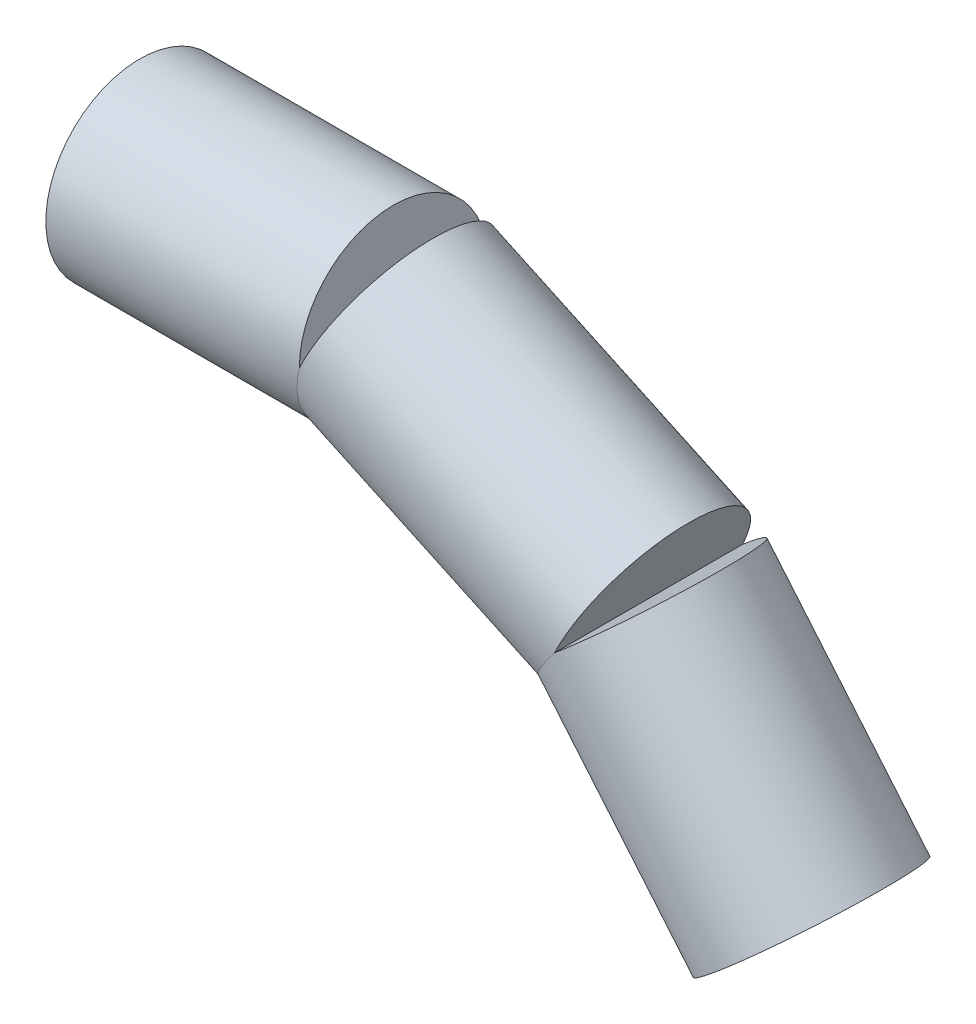
ISO-10303-21;
HEADER;
FILE_DESCRIPTION(('STEP AP214'),'2;1');
FILE_NAME('part.step','',(''),(''),'','','');
FILE_SCHEMA(('AUTOMOTIVE_DESIGN { 1 0 10303 214 1 1 1 1 }'));
ENDSEC;
DATA;
#1=APPLICATION_CONTEXT('core data for automotive mechanical design processes');
#2=APPLICATION_PROTOCOL_DEFINITION('international standard','automotive_design',2000,#1);
#3=PRODUCT_CONTEXT('',#1,'mechanical');
#4=PRODUCT('Part','Part','',(#3));
#5=PRODUCT_RELATED_PRODUCT_CATEGORY('part','',(#4));
#6=PRODUCT_DEFINITION_FORMATION('','',#4);
#7=PRODUCT_DEFINITION_CONTEXT('part definition',#1,'design');
#8=PRODUCT_DEFINITION('design','',#6,#7);
#9=PRODUCT_DEFINITION_SHAPE('','',#8);
#10=(LENGTH_UNIT() NAMED_UNIT(*) SI_UNIT(.MILLI.,.METRE.));
#11=(NAMED_UNIT(*) PLANE_ANGLE_UNIT() SI_UNIT($,.RADIAN.));
#12=(NAMED_UNIT(*) SI_UNIT($,.STERADIAN.) SOLID_ANGLE_UNIT());
#13=UNCERTAINTY_MEASURE_WITH_UNIT(LENGTH_MEASURE(1.E-05),#10,'distance_accuracy_value','');
#14=(GEOMETRIC_REPRESENTATION_CONTEXT(3) GLOBAL_UNCERTAINTY_ASSIGNED_CONTEXT((#13)) GLOBAL_UNIT_ASSIGNED_CONTEXT((#10,
#11,#12)) REPRESENTATION_CONTEXT('',''));
#15=CARTESIAN_POINT('',(0.,0.,0.));
#16=DIRECTION('',(0.,0.,1.));
#17=DIRECTION('',(1.,0.,0.));
#18=AXIS2_PLACEMENT_3D('',#15,#16,#17);
#19=CARTESIAN_POINT('',(45.72,0.,0.));
#20=DIRECTION('',(-1.,0.,0.));
#21=DIRECTION('',(0.,0.,1.));
#22=AXIS2_PLACEMENT_3D('',#19,#20,#21);
#23=CYLINDRICAL_SURFACE('',#22,16.9545);
#24=CARTESIAN_POINT('',(0.,0.,0.));
#25=DIRECTION('',(1.,0.,0.));
#26=DIRECTION('',(0.,0.,-1.));
#27=AXIS2_PLACEMENT_3D('',#24,#25,#26);
#28=CIRCLE('',#27,16.9545);
#29=CARTESIAN_POINT('',(0.,0.,-16.9545));
#30=VERTEX_POINT('',#29);
#31=EDGE_CURVE('E88',#30,#30,#28,.T.);
#32=ORIENTED_EDGE('',*,*,#31,.T.);
#33=EDGE_LOOP('',(#32));
#34=FACE_BOUND('',#33,.T.);
#35=CARTESIAN_POINT('',(45.72,0.,0.));
#36=DIRECTION('',(-0.976296007119933,0.216439613938103,0.));
#37=DIRECTION('',(-0.216439613938103,-0.976296007119933,0.));
#38=AXIS2_PLACEMENT_3D('',#35,#36,#37);
#39=ELLIPSE('',#38,17.3661470254453,16.9545);
#40=CARTESIAN_POINT('',(45.72,0.,16.9545));
#41=VERTEX_POINT('',#40);
#42=CARTESIAN_POINT('',(45.72,0.,-16.9545));
#43=VERTEX_POINT('',#42);
#44=EDGE_CURVE('E63',#41,#43,#39,.F.);
#45=ORIENTED_EDGE('',*,*,#44,.F.);
#46=CARTESIAN_POINT('',(45.72,0.,0.));
#47=DIRECTION('',(1.,0.,0.));
#48=DIRECTION('',(0.,0.,-1.));
#49=AXIS2_PLACEMENT_3D('',#46,#47,#48);
#50=CIRCLE('',#49,16.9545);
#51=EDGE_CURVE('E89',#43,#41,#50,.T.);
#52=ORIENTED_EDGE('',*,*,#51,.F.);
#53=EDGE_LOOP('',(#45,#52));
#54=FACE_BOUND('',#53,.T.);
#55=ADVANCED_FACE('F35',(#34,#54),#23,.T.);
#56=CARTESIAN_POINT('',(45.72,0.,0.));
#57=DIRECTION('',(1.,0.,0.));
#58=DIRECTION('',(0.,0.,-1.));
#59=AXIS2_PLACEMENT_3D('',#56,#57,#58);
#60=PLANE('',#59);
#61=ORIENTED_EDGE('',*,*,#51,.T.);
#62=DIRECTION('',(0.,0.,-1.));
#63=VECTOR('',#62,1.);
#64=CARTESIAN_POINT('',(45.72,0.,0.));
#65=LINE('',#64,#63);
#66=EDGE_CURVE('E42',#41,#43,#65,.T.);
#67=ORIENTED_EDGE('',*,*,#66,.T.);
#68=EDGE_LOOP('',(#61,#67));
#69=FACE_BOUND('',#68,.T.);
#70=ADVANCED_FACE('F96',(#69),#60,.T.);
#71=CARTESIAN_POINT('',(0.,0.,0.));
#72=DIRECTION('',(1.,0.,0.));
#73=DIRECTION('',(0.,0.,-1.));
#74=AXIS2_PLACEMENT_3D('',#71,#72,#73);
#75=PLANE('',#74);
#76=CARTESIAN_POINT('',(0.,0.,0.));
#77=DIRECTION('',(-1.,0.,0.));
#78=DIRECTION('',(0.,0.,1.));
#79=AXIS2_PLACEMENT_3D('',#76,#77,#78);
#80=CIRCLE('',#79,9.525);
#81=CARTESIAN_POINT('',(0.,0.,9.525));
#82=VERTEX_POINT('',#81);
#83=EDGE_CURVE('E225',#82,#82,#80,.T.);
#84=ORIENTED_EDGE('',*,*,#83,.F.);
#85=EDGE_LOOP('',(#84));
#86=FACE_BOUND('',#85,.T.);
#87=ORIENTED_EDGE('',*,*,#31,.F.);
#88=EDGE_LOOP('',(#87));
#89=FACE_BOUND('',#88,.T.);
#90=ADVANCED_FACE('F100',(#86,#89),#75,.F.);
#91=CARTESIAN_POINT('',(91.7604355814618,-21.4690076964276,0.));
#92=DIRECTION('',(-0.90630778703665,0.4226182617407,0.));
#93=DIRECTION('',(-0.4226182617407,-0.90630778703665,0.));
#94=AXIS2_PLACEMENT_3D('',#91,#92,#93);
#95=CYLINDRICAL_SURFACE('',#94,16.9545);
#96=CARTESIAN_POINT('',(91.7604355814618,-21.4690076964276,0.));
#97=DIRECTION('',(0.90630778703665,-0.4226182617407,0.));
#98=DIRECTION('',(0.4226182617407,0.90630778703665,0.));
#99=AXIS2_PLACEMENT_3D('',#96,#97,#98);
#100=CIRCLE('',#99,16.9545);
#101=CARTESIAN_POINT('',(91.7604355814618,-21.4690076964275,-16.9545));
#102=VERTEX_POINT('',#101);
#103=CARTESIAN_POINT('',(91.7604355814618,-21.4690076964275,16.9545));
#104=VERTEX_POINT('',#103);
#105=EDGE_CURVE('E58',#102,#104,#100,.T.);
#106=ORIENTED_EDGE('',*,*,#105,.F.);
#107=CARTESIAN_POINT('',(91.7604355814619,-21.4690076964277,0.));
#108=DIRECTION('',(-0.793353340291234,0.608761429008722,0.));
#109=DIRECTION('',(-0.608761429008722,-0.793353340291234,0.));
#110=AXIS2_PLACEMENT_3D('',#107,#108,#109);
#111=ELLIPSE('',#110,17.3661470254453,16.9545);
#112=EDGE_CURVE('E65',#102,#104,#111,.T.);
#113=ORIENTED_EDGE('',*,*,#112,.T.);
#114=EDGE_LOOP('',(#106,#113));
#115=FACE_BOUND('',#114,.T.);
#116=CARTESIAN_POINT('',(45.72,0.,0.));
#117=DIRECTION('',(0.90630778703665,-0.4226182617407,0.));
#118=DIRECTION('',(0.4226182617407,0.90630778703665,0.));
#119=AXIS2_PLACEMENT_3D('',#116,#117,#118);
#120=CIRCLE('',#119,16.9545);
#121=EDGE_CURVE('E53',#43,#41,#120,.T.);
#122=ORIENTED_EDGE('',*,*,#121,.T.);
#123=ORIENTED_EDGE('',*,*,#44,.T.);
#124=EDGE_LOOP('',(#122,#123));
#125=FACE_BOUND('',#124,.T.);
#126=ADVANCED_FACE('F66',(#115,#125),#95,.T.);
#127=CARTESIAN_POINT('',(91.7604355814618,-21.4690076964276,0.));
#128=DIRECTION('',(0.90630778703665,-0.4226182617407,0.));
#129=DIRECTION('',(0.4226182617407,0.90630778703665,0.));
#130=AXIS2_PLACEMENT_3D('',#127,#128,#129);
#131=PLANE('',#130);
#132=DIRECTION('',(0.,0.,1.));
#133=VECTOR('',#132,1.);
#134=CARTESIAN_POINT('',(91.7604355814618,-21.4690076964275,0.));
#135=LINE('',#134,#133);
#136=EDGE_CURVE('E11',#102,#104,#135,.T.);
#137=ORIENTED_EDGE('',*,*,#136,.F.);
#138=ORIENTED_EDGE('',*,*,#105,.T.);
#139=EDGE_LOOP('',(#137,#138));
#140=FACE_BOUND('',#139,.T.);
#141=ADVANCED_FACE('F60',(#140),#131,.T.);
#142=CARTESIAN_POINT('',(45.72,0.,0.));
#143=DIRECTION('',(0.90630778703665,-0.4226182617407,0.));
#144=DIRECTION('',(0.4226182617407,0.90630778703665,0.));
#145=AXIS2_PLACEMENT_3D('',#142,#143,#144);
#146=PLANE('',#145);
#147=ORIENTED_EDGE('',*,*,#66,.F.);
#148=ORIENTED_EDGE('',*,*,#121,.F.);
#149=EDGE_LOOP('',(#147,#148));
#150=FACE_BOUND('',#149,.T.);
#151=ADVANCED_FACE('F106',(#150),#146,.F.);
#152=CARTESIAN_POINT('',(121.14868509633,-56.4925596358273,0.));
#153=DIRECTION('',(-0.642787609686538,0.766044443118979,0.));
#154=DIRECTION('',(-0.766044443118979,-0.642787609686538,0.));
#155=AXIS2_PLACEMENT_3D('',#152,#153,#154);
#156=CYLINDRICAL_SURFACE('',#155,16.9545);
#157=CARTESIAN_POINT('',(121.14868509633,-56.4925596358273,0.));
#158=DIRECTION('',(-0.642787609686538,0.766044443118979,0.));
#159=DIRECTION('',(-0.766044443118979,-0.642787609686538,0.));
#160=AXIS2_PLACEMENT_3D('',#157,#158,#159);
#161=CIRCLE('',#160,16.9545);
#162=CARTESIAN_POINT('',(108.16078458547,-67.3907021642577,0.));
#163=VERTEX_POINT('',#162);
#164=EDGE_CURVE('E71',#163,#163,#161,.T.);
#165=ORIENTED_EDGE('',*,*,#164,.T.);
#166=EDGE_LOOP('',(#165));
#167=FACE_BOUND('',#166,.T.);
#168=ORIENTED_EDGE('',*,*,#112,.F.);
#169=CARTESIAN_POINT('',(91.7604355814618,-21.4690076964276,0.));
#170=DIRECTION('',(-0.642787609686538,0.766044443118979,0.));
#171=DIRECTION('',(-0.766044443118979,-0.642787609686538,0.));
#172=AXIS2_PLACEMENT_3D('',#169,#170,#171);
#173=CIRCLE('',#172,16.9545);
#174=EDGE_CURVE('E75',#104,#102,#173,.T.);
#175=ORIENTED_EDGE('',*,*,#174,.F.);
#176=EDGE_LOOP('',(#168,#175));
#177=FACE_BOUND('',#176,.T.);
#178=ADVANCED_FACE('F76',(#167,#177),#156,.T.);
#179=CARTESIAN_POINT('',(121.14868509633,-56.4925596358273,0.));
#180=DIRECTION('',(-0.642787609686538,0.766044443118979,0.));
#181=DIRECTION('',(-0.766044443118979,-0.642787609686538,0.));
#182=AXIS2_PLACEMENT_3D('',#179,#180,#181);
#183=PLANE('',#182);
#184=CARTESIAN_POINT('',(121.14868509633,-56.4925596358273,0.));
#185=DIRECTION('',(0.642787609686538,-0.766044443118979,0.));
#186=DIRECTION('',(0.766044443118979,0.642787609686538,0.));
#187=AXIS2_PLACEMENT_3D('',#184,#185,#186);
#188=CIRCLE('',#187,9.52500000000004);
#189=CARTESIAN_POINT('',(128.445258417039,-50.370007653563,0.));
#190=VERTEX_POINT('',#189);
#191=EDGE_CURVE('E82',#190,#190,#188,.T.);
#192=ORIENTED_EDGE('',*,*,#191,.F.);
#193=EDGE_LOOP('',(#192));
#194=FACE_BOUND('',#193,.T.);
#195=ORIENTED_EDGE('',*,*,#164,.F.);
#196=EDGE_LOOP('',(#195));
#197=FACE_BOUND('',#196,.T.);
#198=ADVANCED_FACE('F163',(#194,#197),#183,.F.);
#199=CARTESIAN_POINT('',(91.7604355814618,-21.4690076964276,0.));
#200=DIRECTION('',(-0.642787609686538,0.766044443118979,0.));
#201=DIRECTION('',(-0.766044443118979,-0.642787609686538,0.));
#202=AXIS2_PLACEMENT_3D('',#199,#200,#201);
#203=PLANE('',#202);
#204=ORIENTED_EDGE('',*,*,#174,.T.);
#205=ORIENTED_EDGE('',*,*,#136,.T.);
#206=EDGE_LOOP('',(#204,#205));
#207=FACE_BOUND('',#206,.T.);
#208=ADVANCED_FACE('F74',(#207),#203,.T.);
#209=CARTESIAN_POINT('',(112.985282453311,-46.7637952082163,0.));
#210=DIRECTION('',(0.642787609686538,-0.766044443118979,0.));
#211=DIRECTION('',(0.766044443118979,0.642787609686538,0.));
#212=AXIS2_PLACEMENT_3D('',#209,#210,#211);
#213=CYLINDRICAL_SURFACE('',#212,9.52500000000004);
#214=CARTESIAN_POINT('',(112.985282453311,-46.7637952082163,0.));
#215=DIRECTION('',(0.642787609686538,-0.766044443118979,0.));
#216=DIRECTION('',(0.766044443118979,0.642787609686538,0.));
#217=AXIS2_PLACEMENT_3D('',#214,#215,#216);
#218=CIRCLE('',#217,9.52500000000004);
#219=CARTESIAN_POINT('',(120.28185577402,-40.641243225952,0.));
#220=VERTEX_POINT('',#219);
#221=EDGE_CURVE('E77',#220,#220,#218,.T.);
#222=ORIENTED_EDGE('',*,*,#221,.F.);
#223=EDGE_LOOP('',(#222));
#224=FACE_BOUND('',#223,.T.);
#225=ORIENTED_EDGE('',*,*,#191,.T.);
#226=EDGE_LOOP('',(#225));
#227=FACE_BOUND('',#226,.T.);
#228=ADVANCED_FACE('F158',(#224,#227),#213,.F.);
#229=CARTESIAN_POINT('',(112.985282453311,-46.7637952082163,0.));
#230=DIRECTION('',(0.642787609686538,-0.766044443118979,0.));
#231=DIRECTION('',(0.766044443118979,0.642787609686538,0.));
#232=AXIS2_PLACEMENT_3D('',#229,#230,#231);
#233=PLANE('',#232);
#234=ORIENTED_EDGE('',*,*,#221,.T.);
#235=EDGE_LOOP('',(#234));
#236=FACE_BOUND('',#235,.T.);
#237=ADVANCED_FACE('F131',(#236),#233,.T.);
#238=CARTESIAN_POINT('',(12.7,0.,0.));
#239=DIRECTION('',(-1.,0.,0.));
#240=DIRECTION('',(0.,0.,1.));
#241=AXIS2_PLACEMENT_3D('',#238,#239,#240);
#242=CYLINDRICAL_SURFACE('',#241,9.525);
#243=CARTESIAN_POINT('',(12.7,0.,0.));
#244=DIRECTION('',(-1.,0.,0.));
#245=DIRECTION('',(0.,0.,1.));
#246=AXIS2_PLACEMENT_3D('',#243,#244,#245);
#247=CIRCLE('',#246,9.525);
#248=CARTESIAN_POINT('',(12.7,0.,9.525));
#249=VERTEX_POINT('',#248);
#250=EDGE_CURVE('E224',#249,#249,#247,.T.);
#251=ORIENTED_EDGE('',*,*,#250,.F.);
#252=EDGE_LOOP('',(#251));
#253=FACE_BOUND('',#252,.T.);
#254=ORIENTED_EDGE('',*,*,#83,.T.);
#255=EDGE_LOOP('',(#254));
#256=FACE_BOUND('',#255,.T.);
#257=ADVANCED_FACE('F136',(#253,#256),#242,.F.);
#258=CARTESIAN_POINT('',(12.7,0.,0.));
#259=DIRECTION('',(-1.,0.,0.));
#260=DIRECTION('',(0.,0.,1.));
#261=AXIS2_PLACEMENT_3D('',#258,#259,#260);
#262=PLANE('',#261);
#263=ORIENTED_EDGE('',*,*,#250,.T.);
#264=EDGE_LOOP('',(#263));
#265=FACE_BOUND('',#264,.T.);
#266=ADVANCED_FACE('F141',(#265),#262,.T.);
#267=CLOSED_SHELL('',(#55,#70,#90,#126,#141,#151,#178,#198,#208,#228,#237,#257,#266));
#268=MANIFOLD_SOLID_BREP('B2',#267);
#269=ADVANCED_BREP_SHAPE_REPRESENTATION('',(#18,#268),#14);
#270=SHAPE_DEFINITION_REPRESENTATION(#9,#269);
ENDSEC;
END-ISO-10303-21;
